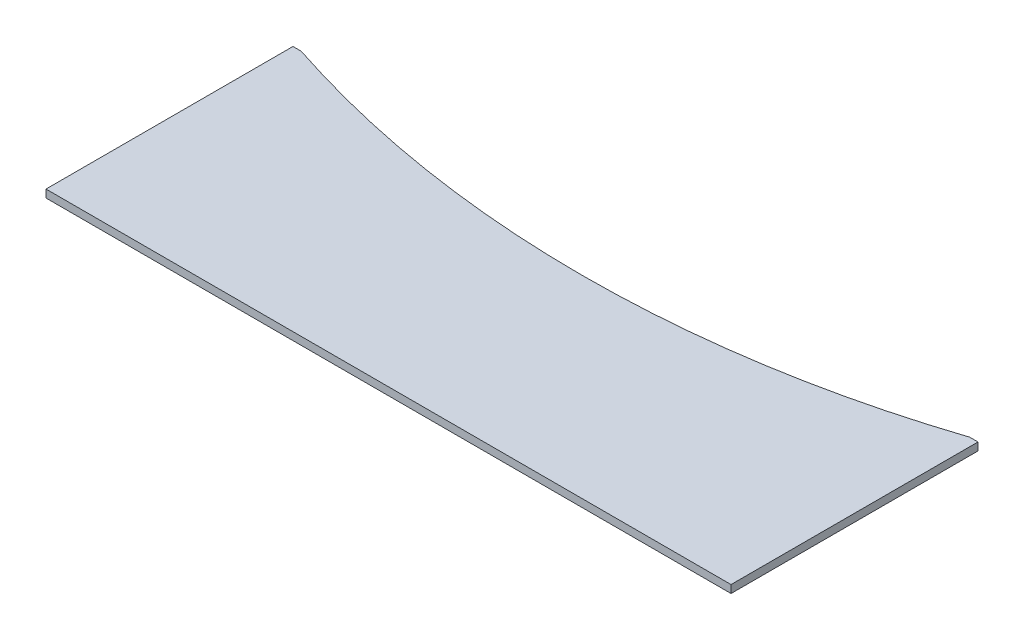
ISO-10303-21;
HEADER;
FILE_DESCRIPTION(('STEP AP214'),'2;1');
FILE_NAME('part.step','',(''),(''),'','','');
FILE_SCHEMA(('AUTOMOTIVE_DESIGN { 1 0 10303 214 1 1 1 1 }'));
ENDSEC;
DATA;
#1=APPLICATION_CONTEXT('core data for automotive mechanical design processes');
#2=APPLICATION_PROTOCOL_DEFINITION('international standard','automotive_design',2000,#1);
#3=PRODUCT_CONTEXT('',#1,'mechanical');
#4=PRODUCT('Part','Part','',(#3));
#5=PRODUCT_RELATED_PRODUCT_CATEGORY('part','',(#4));
#6=PRODUCT_DEFINITION_FORMATION('','',#4);
#7=PRODUCT_DEFINITION_CONTEXT('part definition',#1,'design');
#8=PRODUCT_DEFINITION('design','',#6,#7);
#9=PRODUCT_DEFINITION_SHAPE('','',#8);
#10=(LENGTH_UNIT() NAMED_UNIT(*) SI_UNIT(.MILLI.,.METRE.));
#11=(NAMED_UNIT(*) PLANE_ANGLE_UNIT() SI_UNIT($,.RADIAN.));
#12=(NAMED_UNIT(*) SI_UNIT($,.STERADIAN.) SOLID_ANGLE_UNIT());
#13=UNCERTAINTY_MEASURE_WITH_UNIT(LENGTH_MEASURE(1.E-05),#10,'distance_accuracy_value','');
#14=(GEOMETRIC_REPRESENTATION_CONTEXT(3) GLOBAL_UNCERTAINTY_ASSIGNED_CONTEXT((#13)) GLOBAL_UNIT_ASSIGNED_CONTEXT((#10,
#11,#12)) REPRESENTATION_CONTEXT('',''));
#15=CARTESIAN_POINT('',(0.,0.,0.));
#16=DIRECTION('',(0.,0.,1.));
#17=DIRECTION('',(1.,0.,0.));
#18=AXIS2_PLACEMENT_3D('',#15,#16,#17);
#19=CARTESIAN_POINT('',(0.,0.,-190.));
#20=DIRECTION('',(0.,0.,-1.));
#21=DIRECTION('',(-1.,0.,0.));
#22=AXIS2_PLACEMENT_3D('',#19,#20,#21);
#23=PLANE('',#22);
#24=DIRECTION('',(0.,1.,0.));
#25=VECTOR('',#24,1.);
#26=CARTESIAN_POINT('',(-257.177467908835,-30.,-190.));
#27=LINE('',#26,#25);
#28=CARTESIAN_POINT('',(-257.177467908835,409.,-190.));
#29=VERTEX_POINT('',#28);
#30=CARTESIAN_POINT('',(-257.177467908835,415.,-190.));
#31=VERTEX_POINT('',#30);
#32=EDGE_CURVE('E11',#29,#31,#27,.T.);
#33=ORIENTED_EDGE('',*,*,#32,.F.);
#34=DIRECTION('',(1.,0.,0.));
#35=VECTOR('',#34,1.);
#36=CARTESIAN_POINT('',(-263.5,409.,-190.));
#37=LINE('',#36,#35);
#38=CARTESIAN_POINT('',(-263.5,409.,-190.));
#39=VERTEX_POINT('',#38);
#40=EDGE_CURVE('E98',#39,#29,#37,.T.);
#41=ORIENTED_EDGE('',*,*,#40,.F.);
#42=DIRECTION('',(0.,1.,0.));
#43=VECTOR('',#42,1.);
#44=CARTESIAN_POINT('',(-263.5,409.,-190.));
#45=LINE('',#44,#43);
#46=CARTESIAN_POINT('',(-263.5,415.,-190.));
#47=VERTEX_POINT('',#46);
#48=EDGE_CURVE('E116',#39,#47,#45,.T.);
#49=ORIENTED_EDGE('',*,*,#48,.T.);
#50=DIRECTION('',(1.,0.,0.));
#51=VECTOR('',#50,1.);
#52=CARTESIAN_POINT('',(-263.5,415.,-190.));
#53=LINE('',#52,#51);
#54=EDGE_CURVE('E113',#47,#31,#53,.T.);
#55=ORIENTED_EDGE('',*,*,#54,.T.);
#56=EDGE_LOOP('',(#33,#41,#49,#55));
#57=FACE_BOUND('',#56,.T.);
#58=ADVANCED_FACE('F36',(#57),#23,.T.);
#59=CARTESIAN_POINT('',(-263.5,409.,-190.));
#60=DIRECTION('',(0.,-1.,0.));
#61=DIRECTION('',(0.,0.,-1.));
#62=AXIS2_PLACEMENT_3D('',#59,#60,#61);
#63=PLANE('',#62);
#64=CARTESIAN_POINT('',(0.,409.,-970.732828821742));
#65=DIRECTION('',(0.,-1.,0.));
#66=DIRECTION('',(0.,0.,-1.));
#67=AXIS2_PLACEMENT_3D('',#64,#65,#66);
#68=CIRCLE('',#67,822.);
#69=CARTESIAN_POINT('',(257.177467908835,409.,-190.));
#70=VERTEX_POINT('',#69);
#71=EDGE_CURVE('E93',#70,#29,#68,.T.);
#72=ORIENTED_EDGE('',*,*,#71,.F.);
#73=CARTESIAN_POINT('',(263.5,409.,-190.));
#74=VERTEX_POINT('',#73);
#75=EDGE_CURVE('E83',#70,#74,#37,.T.);
#76=ORIENTED_EDGE('',*,*,#75,.T.);
#77=DIRECTION('',(0.,0.,1.));
#78=VECTOR('',#77,1.);
#79=CARTESIAN_POINT('',(263.5,409.,-190.));
#80=LINE('',#79,#78);
#81=CARTESIAN_POINT('',(263.5,409.,0.));
#82=VERTEX_POINT('',#81);
#83=EDGE_CURVE('E118',#74,#82,#80,.T.);
#84=ORIENTED_EDGE('',*,*,#83,.T.);
#85=DIRECTION('',(1.,0.,0.));
#86=VECTOR('',#85,1.);
#87=CARTESIAN_POINT('',(-263.5,409.,0.));
#88=LINE('',#87,#86);
#89=CARTESIAN_POINT('',(-263.5,409.,0.));
#90=VERTEX_POINT('',#89);
#91=EDGE_CURVE('E99',#90,#82,#88,.T.);
#92=ORIENTED_EDGE('',*,*,#91,.F.);
#93=DIRECTION('',(0.,0.,1.));
#94=VECTOR('',#93,1.);
#95=CARTESIAN_POINT('',(-263.5,409.,-190.));
#96=LINE('',#95,#94);
#97=EDGE_CURVE('E59',#39,#90,#96,.T.);
#98=ORIENTED_EDGE('',*,*,#97,.F.);
#99=ORIENTED_EDGE('',*,*,#40,.T.);
#100=EDGE_LOOP('',(#72,#76,#84,#92,#98,#99));
#101=FACE_BOUND('',#100,.T.);
#102=ADVANCED_FACE('F38',(#101),#63,.T.);
#103=CARTESIAN_POINT('',(-263.5,409.,-190.));
#104=DIRECTION('',(1.,0.,0.));
#105=DIRECTION('',(0.,0.,-1.));
#106=AXIS2_PLACEMENT_3D('',#103,#104,#105);
#107=PLANE('',#106);
#108=DIRECTION('',(0.,1.,0.));
#109=VECTOR('',#108,1.);
#110=CARTESIAN_POINT('',(-263.5,409.,0.));
#111=LINE('',#110,#109);
#112=CARTESIAN_POINT('',(-263.5,415.,0.));
#113=VERTEX_POINT('',#112);
#114=EDGE_CURVE('E105',#90,#113,#111,.T.);
#115=ORIENTED_EDGE('',*,*,#114,.T.);
#116=DIRECTION('',(0.,0.,1.));
#117=VECTOR('',#116,1.);
#118=CARTESIAN_POINT('',(-263.5,415.,-190.));
#119=LINE('',#118,#117);
#120=EDGE_CURVE('E126',#47,#113,#119,.T.);
#121=ORIENTED_EDGE('',*,*,#120,.F.);
#122=ORIENTED_EDGE('',*,*,#48,.F.);
#123=ORIENTED_EDGE('',*,*,#97,.T.);
#124=EDGE_LOOP('',(#115,#121,#122,#123));
#125=FACE_BOUND('',#124,.T.);
#126=ADVANCED_FACE('F140',(#125),#107,.F.);
#127=CARTESIAN_POINT('',(-263.5,415.,-190.));
#128=DIRECTION('',(0.,-1.,0.));
#129=DIRECTION('',(0.,0.,-1.));
#130=AXIS2_PLACEMENT_3D('',#127,#128,#129);
#131=PLANE('',#130);
#132=CARTESIAN_POINT('',(257.177467908835,415.,-190.));
#133=VERTEX_POINT('',#132);
#134=CARTESIAN_POINT('',(263.5,415.,-190.));
#135=VERTEX_POINT('',#134);
#136=EDGE_CURVE('E112',#133,#135,#53,.T.);
#137=ORIENTED_EDGE('',*,*,#136,.F.);
#138=CARTESIAN_POINT('',(0.,415.,-970.732828821742));
#139=DIRECTION('',(0.,-1.,0.));
#140=DIRECTION('',(0.,0.,-1.));
#141=AXIS2_PLACEMENT_3D('',#138,#139,#140);
#142=CIRCLE('',#141,822.);
#143=EDGE_CURVE('E50',#133,#31,#142,.T.);
#144=ORIENTED_EDGE('',*,*,#143,.T.);
#145=ORIENTED_EDGE('',*,*,#54,.F.);
#146=ORIENTED_EDGE('',*,*,#120,.T.);
#147=DIRECTION('',(1.,0.,0.));
#148=VECTOR('',#147,1.);
#149=CARTESIAN_POINT('',(-263.5,415.,0.));
#150=LINE('',#149,#148);
#151=CARTESIAN_POINT('',(263.5,415.,0.));
#152=VERTEX_POINT('',#151);
#153=EDGE_CURVE('E107',#113,#152,#150,.T.);
#154=ORIENTED_EDGE('',*,*,#153,.T.);
#155=DIRECTION('',(0.,0.,1.));
#156=VECTOR('',#155,1.);
#157=CARTESIAN_POINT('',(263.5,415.,-190.));
#158=LINE('',#157,#156);
#159=EDGE_CURVE('E129',#135,#152,#158,.T.);
#160=ORIENTED_EDGE('',*,*,#159,.F.);
#161=EDGE_LOOP('',(#137,#144,#145,#146,#154,#160));
#162=FACE_BOUND('',#161,.T.);
#163=ADVANCED_FACE('F143',(#162),#131,.F.);
#164=CARTESIAN_POINT('',(263.5,415.,-190.));
#165=DIRECTION('',(-1.,0.,0.));
#166=DIRECTION('',(0.,0.,1.));
#167=AXIS2_PLACEMENT_3D('',#164,#165,#166);
#168=PLANE('',#167);
#169=DIRECTION('',(0.,-1.,0.));
#170=VECTOR('',#169,1.);
#171=CARTESIAN_POINT('',(263.5,415.,0.));
#172=LINE('',#171,#170);
#173=EDGE_CURVE('E121',#152,#82,#172,.T.);
#174=ORIENTED_EDGE('',*,*,#173,.T.);
#175=ORIENTED_EDGE('',*,*,#83,.F.);
#176=DIRECTION('',(0.,-1.,0.));
#177=VECTOR('',#176,1.);
#178=CARTESIAN_POINT('',(263.5,415.,-190.));
#179=LINE('',#178,#177);
#180=EDGE_CURVE('E103',#135,#74,#179,.T.);
#181=ORIENTED_EDGE('',*,*,#180,.F.);
#182=ORIENTED_EDGE('',*,*,#159,.T.);
#183=EDGE_LOOP('',(#174,#175,#181,#182));
#184=FACE_BOUND('',#183,.T.);
#185=ADVANCED_FACE('F134',(#184),#168,.F.);
#186=DIRECTION('',(0.,1.,0.));
#187=VECTOR('',#186,1.);
#188=CARTESIAN_POINT('',(257.177467908835,-30.,-190.));
#189=LINE('',#188,#187);
#190=EDGE_CURVE('E44',#133,#70,#189,.F.);
#191=ORIENTED_EDGE('',*,*,#190,.F.);
#192=ORIENTED_EDGE('',*,*,#136,.T.);
#193=ORIENTED_EDGE('',*,*,#180,.T.);
#194=ORIENTED_EDGE('',*,*,#75,.F.);
#195=EDGE_LOOP('',(#191,#192,#193,#194));
#196=FACE_BOUND('',#195,.T.);
#197=ADVANCED_FACE('F101',(#196),#23,.T.);
#198=CARTESIAN_POINT('',(0.,0.,0.));
#199=DIRECTION('',(0.,0.,-1.));
#200=DIRECTION('',(-1.,0.,0.));
#201=AXIS2_PLACEMENT_3D('',#198,#199,#200);
#202=PLANE('',#201);
#203=ORIENTED_EDGE('',*,*,#91,.T.);
#204=ORIENTED_EDGE('',*,*,#173,.F.);
#205=ORIENTED_EDGE('',*,*,#153,.F.);
#206=ORIENTED_EDGE('',*,*,#114,.F.);
#207=EDGE_LOOP('',(#203,#204,#205,#206));
#208=FACE_BOUND('',#207,.T.);
#209=ADVANCED_FACE('F138',(#208),#202,.F.);
#210=CARTESIAN_POINT('',(0.,-30.,-970.732828821742));
#211=DIRECTION('',(0.,1.,0.));
#212=DIRECTION('',(0.,0.,1.));
#213=AXIS2_PLACEMENT_3D('',#210,#211,#212);
#214=CYLINDRICAL_SURFACE('',#213,822.);
#215=ORIENTED_EDGE('',*,*,#32,.T.);
#216=ORIENTED_EDGE('',*,*,#143,.F.);
#217=ORIENTED_EDGE('',*,*,#190,.T.);
#218=ORIENTED_EDGE('',*,*,#71,.T.);
#219=EDGE_LOOP('',(#215,#216,#217,#218));
#220=FACE_BOUND('',#219,.T.);
#221=ADVANCED_FACE('F92',(#220),#214,.F.);
#222=CLOSED_SHELL('',(#58,#102,#126,#163,#185,#197,#209,#221));
#223=MANIFOLD_SOLID_BREP('B2',#222);
#224=ADVANCED_BREP_SHAPE_REPRESENTATION('',(#18,#223),#14);
#225=SHAPE_DEFINITION_REPRESENTATION(#9,#224);
ENDSEC;
END-ISO-10303-21;
